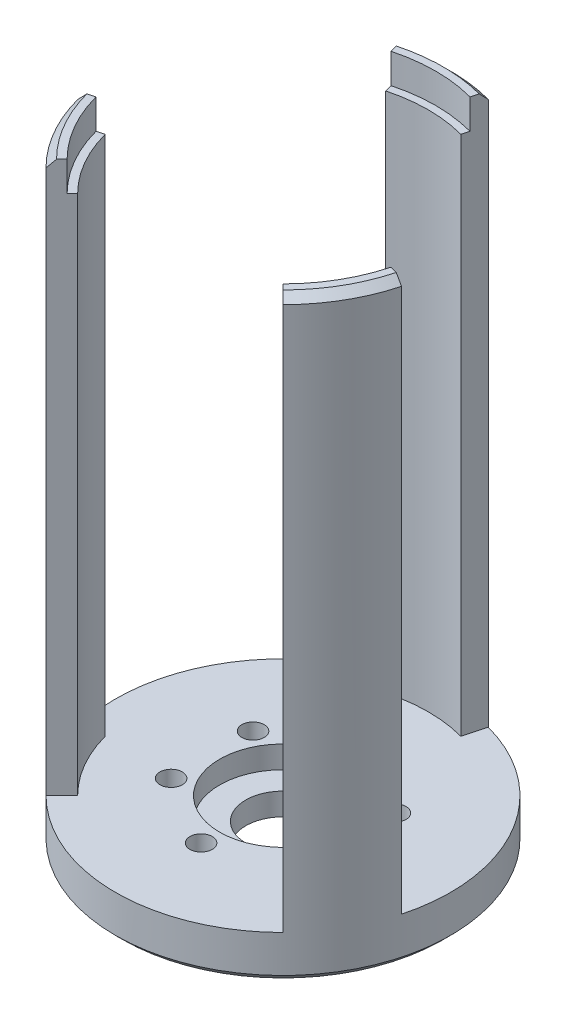
ISO-10303-21;
HEADER;
FILE_DESCRIPTION(('STEP AP214'),'2;1');
FILE_NAME('part.step','',(''),(''),'','','');
FILE_SCHEMA(('AUTOMOTIVE_DESIGN { 1 0 10303 214 1 1 1 1 }'));
ENDSEC;
DATA;
#1=APPLICATION_CONTEXT('core data for automotive mechanical design processes');
#2=APPLICATION_PROTOCOL_DEFINITION('international standard','automotive_design',2000,#1);
#3=PRODUCT_CONTEXT('',#1,'mechanical');
#4=PRODUCT('Part','Part','',(#3));
#5=PRODUCT_RELATED_PRODUCT_CATEGORY('part','',(#4));
#6=PRODUCT_DEFINITION_FORMATION('','',#4);
#7=PRODUCT_DEFINITION_CONTEXT('part definition',#1,'design');
#8=PRODUCT_DEFINITION('design','',#6,#7);
#9=PRODUCT_DEFINITION_SHAPE('','',#8);
#10=(LENGTH_UNIT() NAMED_UNIT(*) SI_UNIT(.MILLI.,.METRE.));
#11=(NAMED_UNIT(*) PLANE_ANGLE_UNIT() SI_UNIT($,.RADIAN.));
#12=(NAMED_UNIT(*) SI_UNIT($,.STERADIAN.) SOLID_ANGLE_UNIT());
#13=UNCERTAINTY_MEASURE_WITH_UNIT(LENGTH_MEASURE(1.E-05),#10,'distance_accuracy_value','');
#14=(GEOMETRIC_REPRESENTATION_CONTEXT(3) GLOBAL_UNCERTAINTY_ASSIGNED_CONTEXT((#13)) GLOBAL_UNIT_ASSIGNED_CONTEXT((#10,
#11,#12)) REPRESENTATION_CONTEXT('',''));
#15=CARTESIAN_POINT('',(0.,0.,0.));
#16=DIRECTION('',(0.,0.,1.));
#17=DIRECTION('',(1.,0.,0.));
#18=AXIS2_PLACEMENT_3D('',#15,#16,#17);
#19=CARTESIAN_POINT('',(0.,80.,0.));
#20=DIRECTION('',(0.,-1.,0.));
#21=DIRECTION('',(0.,0.,-1.));
#22=AXIS2_PLACEMENT_3D('',#19,#20,#21);
#23=CYLINDRICAL_SURFACE('',#22,19.5);
#24=CARTESIAN_POINT('',(0.,76.,0.));
#25=DIRECTION('',(0.,1.,0.));
#26=DIRECTION('',(0.,0.,1.));
#27=AXIS2_PLACEMENT_3D('',#24,#25,#26);
#28=CIRCLE('',#27,19.5);
#29=CARTESIAN_POINT('',(18.8355536126368,76.,5.04697137949923));
#30=VERTEX_POINT('',#29);
#31=CARTESIAN_POINT('',(13.7885822331376,76.,13.7885822331378));
#32=VERTEX_POINT('',#31);
#33=EDGE_CURVE('E196',#30,#32,#28,.F.);
#34=ORIENTED_EDGE('',*,*,#33,.F.);
#35=DIRECTION('',(0.,-1.,0.));
#36=VECTOR('',#35,1.);
#37=CARTESIAN_POINT('',(18.8355536126368,80.,5.04697137949923));
#38=LINE('',#37,#36);
#39=CARTESIAN_POINT('',(18.8355536126368,6.,5.04697137949923));
#40=VERTEX_POINT('',#39);
#41=EDGE_CURVE('E314',#30,#40,#38,.T.);
#42=ORIENTED_EDGE('',*,*,#41,.T.);
#43=CARTESIAN_POINT('',(0.,6.,0.));
#44=DIRECTION('',(0.,-1.,0.));
#45=DIRECTION('',(0.,0.,1.));
#46=AXIS2_PLACEMENT_3D('',#43,#44,#45);
#47=CIRCLE('',#46,19.5);
#48=CARTESIAN_POINT('',(13.7885822331376,6.,13.7885822331378));
#49=VERTEX_POINT('',#48);
#50=EDGE_CURVE('E307',#40,#49,#47,.T.);
#51=ORIENTED_EDGE('',*,*,#50,.T.);
#52=DIRECTION('',(0.,-1.,0.));
#53=VECTOR('',#52,1.);
#54=CARTESIAN_POINT('',(13.7885822331376,80.,13.7885822331378));
#55=LINE('',#54,#53);
#56=EDGE_CURVE('E333',#32,#49,#55,.T.);
#57=ORIENTED_EDGE('',*,*,#56,.F.);
#58=EDGE_LOOP('',(#34,#42,#51,#57));
#59=FACE_BOUND('',#58,.T.);
#60=ADVANCED_FACE('F43',(#59),#23,.F.);
#61=CARTESIAN_POINT('',(0.,80.,0.));
#62=DIRECTION('',(0.,-1.,0.));
#63=DIRECTION('',(0.,0.,-1.));
#64=AXIS2_PLACEMENT_3D('',#61,#62,#63);
#65=CYLINDRICAL_SURFACE('',#64,19.5);
#66=CARTESIAN_POINT('',(0.,76.,0.));
#67=DIRECTION('',(0.,1.,0.));
#68=DIRECTION('',(0.,0.,1.));
#69=AXIS2_PLACEMENT_3D('',#66,#67,#68);
#70=CIRCLE('',#69,19.5);
#71=CARTESIAN_POINT('',(-5.04697137949917,76.,-18.8355536126368));
#72=VERTEX_POINT('',#71);
#73=CARTESIAN_POINT('',(5.04697137949917,76.,-18.8355536126368));
#74=VERTEX_POINT('',#73);
#75=EDGE_CURVE('E236',#72,#74,#70,.F.);
#76=ORIENTED_EDGE('',*,*,#75,.F.);
#77=DIRECTION('',(0.,-1.,0.));
#78=VECTOR('',#77,1.);
#79=CARTESIAN_POINT('',(-5.04697137949917,80.,-18.8355536126368));
#80=LINE('',#79,#78);
#81=CARTESIAN_POINT('',(-5.04697137949918,6.,-18.8355536126368));
#82=VERTEX_POINT('',#81);
#83=EDGE_CURVE('E285',#72,#82,#80,.T.);
#84=ORIENTED_EDGE('',*,*,#83,.T.);
#85=CARTESIAN_POINT('',(0.,6.,0.));
#86=DIRECTION('',(0.,-1.,0.));
#87=DIRECTION('',(0.,0.,1.));
#88=AXIS2_PLACEMENT_3D('',#85,#86,#87);
#89=CIRCLE('',#88,19.5);
#90=CARTESIAN_POINT('',(5.04697137949917,6.00000000000001,-18.8355536126368));
#91=VERTEX_POINT('',#90);
#92=EDGE_CURVE('E276',#82,#91,#89,.T.);
#93=ORIENTED_EDGE('',*,*,#92,.T.);
#94=DIRECTION('',(0.,-1.,0.));
#95=VECTOR('',#94,1.);
#96=CARTESIAN_POINT('',(5.04697137949917,80.,-18.8355536126368));
#97=LINE('',#96,#95);
#98=EDGE_CURVE('E304',#74,#91,#97,.T.);
#99=ORIENTED_EDGE('',*,*,#98,.F.);
#100=EDGE_LOOP('',(#76,#84,#93,#99));
#101=FACE_BOUND('',#100,.T.);
#102=ADVANCED_FACE('F550',(#101),#65,.F.);
#103=CARTESIAN_POINT('',(0.,80.,0.));
#104=DIRECTION('',(0.,-1.,0.));
#105=DIRECTION('',(0.,0.,-1.));
#106=AXIS2_PLACEMENT_3D('',#103,#104,#105);
#107=CYLINDRICAL_SURFACE('',#106,19.5);
#108=CARTESIAN_POINT('',(0.,76.,0.));
#109=DIRECTION('',(0.,1.,0.));
#110=DIRECTION('',(0.,0.,1.));
#111=AXIS2_PLACEMENT_3D('',#108,#109,#110);
#112=CIRCLE('',#111,19.5);
#113=CARTESIAN_POINT('',(-13.7885822331378,76.,13.7885822331376));
#114=VERTEX_POINT('',#113);
#115=CARTESIAN_POINT('',(-18.8355536126369,76.,5.04697137949897));
#116=VERTEX_POINT('',#115);
#117=EDGE_CURVE('E221',#114,#116,#112,.F.);
#118=ORIENTED_EDGE('',*,*,#117,.F.);
#119=DIRECTION('',(0.,-1.,0.));
#120=VECTOR('',#119,1.);
#121=CARTESIAN_POINT('',(-13.7885822331378,80.,13.7885822331376));
#122=LINE('',#121,#120);
#123=CARTESIAN_POINT('',(-13.7885822331378,6.,13.7885822331396));
#124=VERTEX_POINT('',#123);
#125=EDGE_CURVE('E254',#114,#124,#122,.T.);
#126=ORIENTED_EDGE('',*,*,#125,.T.);
#127=CARTESIAN_POINT('',(0.,6.,0.));
#128=DIRECTION('',(0.,-1.,0.));
#129=DIRECTION('',(0.,0.,1.));
#130=AXIS2_PLACEMENT_3D('',#127,#128,#129);
#131=CIRCLE('',#130,19.5);
#132=CARTESIAN_POINT('',(-18.8355536126369,6.00000000000001,5.04697137949897));
#133=VERTEX_POINT('',#132);
#134=EDGE_CURVE('E201',#124,#133,#131,.T.);
#135=ORIENTED_EDGE('',*,*,#134,.T.);
#136=DIRECTION('',(0.,-1.,0.));
#137=VECTOR('',#136,1.);
#138=CARTESIAN_POINT('',(-18.8355536126369,80.,5.04697137949897));
#139=LINE('',#138,#137);
#140=EDGE_CURVE('E273',#116,#133,#139,.T.);
#141=ORIENTED_EDGE('',*,*,#140,.F.);
#142=EDGE_LOOP('',(#118,#126,#135,#141));
#143=FACE_BOUND('',#142,.T.);
#144=ADVANCED_FACE('F579',(#143),#107,.F.);
#145=CARTESIAN_POINT('',(0.,6.,0.));
#146=DIRECTION('',(0.,1.,0.));
#147=DIRECTION('',(0.,0.,1.));
#148=AXIS2_PLACEMENT_3D('',#145,#146,#147);
#149=PLANE('',#148);
#150=CARTESIAN_POINT('',(0.,6.,0.));
#151=DIRECTION('',(0.,1.,0.));
#152=DIRECTION('',(0.,0.,1.));
#153=AXIS2_PLACEMENT_3D('',#150,#151,#152);
#154=CIRCLE('',#153,8.5);
#155=CARTESIAN_POINT('',(0.,6.,8.5));
#156=VERTEX_POINT('',#155);
#157=EDGE_CURVE('E366',#156,#156,#154,.T.);
#158=ORIENTED_EDGE('',*,*,#157,.F.);
#159=EDGE_LOOP('',(#158));
#160=FACE_BOUND('',#159,.T.);
#161=CARTESIAN_POINT('',(-9.52627944162778,6.,-5.5000000000018));
#162=DIRECTION('',(0.,1.,0.));
#163=DIRECTION('',(0.,0.,1.));
#164=AXIS2_PLACEMENT_3D('',#161,#162,#163);
#165=CIRCLE('',#164,1.5);
#166=CARTESIAN_POINT('',(-9.52627944162778,6.,-4.0000000000018));
#167=VERTEX_POINT('',#166);
#168=EDGE_CURVE('E375',#167,#167,#165,.T.);
#169=ORIENTED_EDGE('',*,*,#168,.F.);
#170=EDGE_LOOP('',(#169));
#171=FACE_BOUND('',#170,.T.);
#172=CARTESIAN_POINT('',(-1.2490009027033E-12,6.,11.));
#173=DIRECTION('',(0.,1.,0.));
#174=DIRECTION('',(0.,0.,1.));
#175=AXIS2_PLACEMENT_3D('',#172,#173,#174);
#176=CIRCLE('',#175,1.5);
#177=CARTESIAN_POINT('',(-1.2490009027033E-12,6.,12.5));
#178=VERTEX_POINT('',#177);
#179=EDGE_CURVE('E384',#178,#178,#176,.T.);
#180=ORIENTED_EDGE('',*,*,#179,.F.);
#181=EDGE_LOOP('',(#180));
#182=FACE_BOUND('',#181,.T.);
#183=CARTESIAN_POINT('',(9.52627944162903,6.,-5.49999999999964));
#184=DIRECTION('',(0.,1.,0.));
#185=DIRECTION('',(0.,0.,1.));
#186=AXIS2_PLACEMENT_3D('',#183,#184,#185);
#187=CIRCLE('',#186,1.5);
#188=CARTESIAN_POINT('',(9.52627944162903,6.,-3.99999999999964));
#189=VERTEX_POINT('',#188);
#190=EDGE_CURVE('E396',#189,#189,#187,.T.);
#191=ORIENTED_EDGE('',*,*,#190,.F.);
#192=EDGE_LOOP('',(#191));
#193=FACE_BOUND('',#192,.T.);
#194=CARTESIAN_POINT('',(0.,6.,-11.));
#195=DIRECTION('',(0.,1.,0.));
#196=DIRECTION('',(0.,0.,1.));
#197=AXIS2_PLACEMENT_3D('',#194,#195,#196);
#198=CIRCLE('',#197,1.5);
#199=CARTESIAN_POINT('',(0.,6.,-9.5));
#200=VERTEX_POINT('',#199);
#201=EDGE_CURVE('E404',#200,#200,#198,.T.);
#202=ORIENTED_EDGE('',*,*,#201,.F.);
#203=EDGE_LOOP('',(#202));
#204=FACE_BOUND('',#203,.T.);
#205=CARTESIAN_POINT('',(9.52627944162841,6.,5.50000000000072));
#206=DIRECTION('',(0.,1.,0.));
#207=DIRECTION('',(0.,0.,1.));
#208=AXIS2_PLACEMENT_3D('',#205,#206,#207);
#209=CIRCLE('',#208,1.5);
#210=CARTESIAN_POINT('',(9.52627944162841,6.,7.00000000000072));
#211=VERTEX_POINT('',#210);
#212=EDGE_CURVE('E392',#211,#211,#209,.T.);
#213=ORIENTED_EDGE('',*,*,#212,.F.);
#214=EDGE_LOOP('',(#213));
#215=FACE_BOUND('',#214,.T.);
#216=CARTESIAN_POINT('',(-9.52627944162966,6.,5.49999999999856));
#217=DIRECTION('',(0.,1.,0.));
#218=DIRECTION('',(0.,0.,1.));
#219=AXIS2_PLACEMENT_3D('',#216,#217,#218);
#220=CIRCLE('',#219,1.5);
#221=CARTESIAN_POINT('',(-9.52627944162966,6.,6.99999999999856));
#222=VERTEX_POINT('',#221);
#223=EDGE_CURVE('E380',#222,#222,#220,.T.);
#224=ORIENTED_EDGE('',*,*,#223,.F.);
#225=EDGE_LOOP('',(#224));
#226=FACE_BOUND('',#225,.T.);
#227=CARTESIAN_POINT('',(0.,6.,0.));
#228=DIRECTION('',(0.,1.,0.));
#229=DIRECTION('',(0.,0.,1.));
#230=AXIS2_PLACEMENT_3D('',#227,#228,#229);
#231=CIRCLE('',#230,22.5);
#232=CARTESIAN_POINT('',(-5.82342851480673,6.,-21.733331091504));
#233=VERTEX_POINT('',#232);
#234=CARTESIAN_POINT('',(-21.733331091504,6.,5.82342851480671));
#235=VERTEX_POINT('',#234);
#236=EDGE_CURVE('E417',#233,#235,#231,.T.);
#237=ORIENTED_EDGE('',*,*,#236,.T.);
#238=DIRECTION('',(-0.965925826289052,0.,0.25881904510258));
#239=VECTOR('',#238,1.);
#240=CARTESIAN_POINT('',(-18.8355536126369,6.,5.04697137949897));
#241=LINE('',#240,#239);
#242=EDGE_CURVE('E258',#133,#235,#241,.T.);
#243=ORIENTED_EDGE('',*,*,#242,.F.);
#244=ORIENTED_EDGE('',*,*,#134,.F.);
#245=DIRECTION('',(0.707106781186501,0.,-0.707106781186594));
#246=VECTOR('',#245,1.);
#247=CARTESIAN_POINT('',(-13.7885822331378,6.,13.7885822331376));
#248=LINE('',#247,#246);
#249=CARTESIAN_POINT('',(-15.9099025766973,6.,15.9099025766973));
#250=VERTEX_POINT('',#249);
#251=EDGE_CURVE('E251',#250,#124,#248,.T.);
#252=ORIENTED_EDGE('',*,*,#251,.F.);
#253=CARTESIAN_POINT('',(15.9099025766973,6.,15.9099025766973));
#254=VERTEX_POINT('',#253);
#255=EDGE_CURVE('E408',#250,#254,#231,.T.);
#256=ORIENTED_EDGE('',*,*,#255,.T.);
#257=DIRECTION('',(0.707106781186569,0.,0.707106781186526));
#258=VECTOR('',#257,1.);
#259=CARTESIAN_POINT('',(13.7885822331376,6.,13.7885822331378));
#260=LINE('',#259,#258);
#261=EDGE_CURVE('E318',#49,#254,#260,.T.);
#262=ORIENTED_EDGE('',*,*,#261,.F.);
#263=ORIENTED_EDGE('',*,*,#50,.F.);
#264=DIRECTION('',(-0.965925826289077,0.,-0.258819045102488));
#265=VECTOR('',#264,1.);
#266=CARTESIAN_POINT('',(18.8355536126368,6.,5.04697137949923));
#267=LINE('',#266,#265);
#268=CARTESIAN_POINT('',(21.733331091504,6.,5.8234285148067));
#269=VERTEX_POINT('',#268);
#270=EDGE_CURVE('E311',#269,#40,#267,.T.);
#271=ORIENTED_EDGE('',*,*,#270,.F.);
#272=CARTESIAN_POINT('',(5.82342851480673,6.,-21.733331091504));
#273=VERTEX_POINT('',#272);
#274=EDGE_CURVE('E412',#269,#273,#231,.T.);
#275=ORIENTED_EDGE('',*,*,#274,.T.);
#276=DIRECTION('',(0.258819045102522,0.,-0.965925826289068));
#277=VECTOR('',#276,1.);
#278=CARTESIAN_POINT('',(5.04697137949917,6.,-18.8355536126368));
#279=LINE('',#278,#277);
#280=EDGE_CURVE('E289',#91,#273,#279,.T.);
#281=ORIENTED_EDGE('',*,*,#280,.F.);
#282=ORIENTED_EDGE('',*,*,#92,.F.);
#283=DIRECTION('',(0.258819045102522,0.,0.965925826289068));
#284=VECTOR('',#283,1.);
#285=CARTESIAN_POINT('',(-5.04697137949917,6.,-18.8355536126368));
#286=LINE('',#285,#284);
#287=EDGE_CURVE('E282',#233,#82,#286,.T.);
#288=ORIENTED_EDGE('',*,*,#287,.F.);
#289=EDGE_LOOP('',(#237,#243,#244,#252,#256,#262,#263,#271,#275,#281,#282,#288));
#290=FACE_BOUND('',#289,.T.);
#291=ADVANCED_FACE('F483',(#160,#171,#182,#193,#204,#215,#226,#290),#149,.T.);
#292=CARTESIAN_POINT('',(9.52627944162903,6.,-5.49999999999964));
#293=DIRECTION('',(0.,-1.,0.));
#294=DIRECTION('',(0.,0.,-1.));
#295=AXIS2_PLACEMENT_3D('',#292,#293,#294);
#296=CYLINDRICAL_SURFACE('',#295,1.5);
#297=ORIENTED_EDGE('',*,*,#190,.T.);
#298=EDGE_LOOP('',(#297));
#299=FACE_BOUND('',#298,.T.);
#300=CARTESIAN_POINT('',(9.52627944162903,2.5,-5.49999999999964));
#301=DIRECTION('',(0.,-1.,0.));
#302=DIRECTION('',(0.,0.,-1.));
#303=AXIS2_PLACEMENT_3D('',#300,#301,#302);
#304=CIRCLE('',#303,1.5);
#305=CARTESIAN_POINT('',(9.52627944162903,2.5,-6.99999999999964));
#306=VERTEX_POINT('',#305);
#307=EDGE_CURVE('E370',#306,#306,#304,.T.);
#308=ORIENTED_EDGE('',*,*,#307,.T.);
#309=EDGE_LOOP('',(#308));
#310=FACE_BOUND('',#309,.T.);
#311=ADVANCED_FACE('F586',(#299,#310),#296,.F.);
#312=CARTESIAN_POINT('',(-1.2490009027033E-12,6.,11.));
#313=DIRECTION('',(0.,-1.,0.));
#314=DIRECTION('',(0.,0.,-1.));
#315=AXIS2_PLACEMENT_3D('',#312,#313,#314);
#316=CYLINDRICAL_SURFACE('',#315,1.5);
#317=ORIENTED_EDGE('',*,*,#179,.T.);
#318=EDGE_LOOP('',(#317));
#319=FACE_BOUND('',#318,.T.);
#320=CARTESIAN_POINT('',(-1.2490009027033E-12,2.5,11.));
#321=DIRECTION('',(0.,-1.,0.));
#322=DIRECTION('',(0.,0.,-1.));
#323=AXIS2_PLACEMENT_3D('',#320,#321,#322);
#324=CIRCLE('',#323,1.5);
#325=CARTESIAN_POINT('',(-1.2490009027033E-12,2.5,9.5));
#326=VERTEX_POINT('',#325);
#327=EDGE_CURVE('E424',#326,#326,#324,.T.);
#328=ORIENTED_EDGE('',*,*,#327,.T.);
#329=EDGE_LOOP('',(#328));
#330=FACE_BOUND('',#329,.T.);
#331=ADVANCED_FACE('F640',(#319,#330),#316,.F.);
#332=CARTESIAN_POINT('',(-9.52627944162778,6.,-5.5000000000018));
#333=DIRECTION('',(0.,-1.,0.));
#334=DIRECTION('',(0.,0.,-1.));
#335=AXIS2_PLACEMENT_3D('',#332,#333,#334);
#336=CYLINDRICAL_SURFACE('',#335,1.5);
#337=ORIENTED_EDGE('',*,*,#168,.T.);
#338=EDGE_LOOP('',(#337));
#339=FACE_BOUND('',#338,.T.);
#340=CARTESIAN_POINT('',(-9.52627944162778,2.5,-5.5000000000018));
#341=DIRECTION('',(0.,-1.,0.));
#342=DIRECTION('',(0.,0.,-1.));
#343=AXIS2_PLACEMENT_3D('',#340,#341,#342);
#344=CIRCLE('',#343,1.5);
#345=CARTESIAN_POINT('',(-9.52627944162778,2.5,-7.0000000000018));
#346=VERTEX_POINT('',#345);
#347=EDGE_CURVE('E341',#346,#346,#344,.T.);
#348=ORIENTED_EDGE('',*,*,#347,.T.);
#349=EDGE_LOOP('',(#348));
#350=FACE_BOUND('',#349,.T.);
#351=ADVANCED_FACE('F636',(#339,#350),#336,.F.);
#352=CARTESIAN_POINT('',(0.,6.,0.));
#353=DIRECTION('',(0.,-1.,0.));
#354=DIRECTION('',(0.,0.,-1.));
#355=AXIS2_PLACEMENT_3D('',#352,#353,#354);
#356=CYLINDRICAL_SURFACE('',#355,5.);
#357=CARTESIAN_POINT('',(0.,0.,0.));
#358=DIRECTION('',(0.,1.,0.));
#359=DIRECTION('',(0.,0.,1.));
#360=AXIS2_PLACEMENT_3D('',#357,#358,#359);
#361=CIRCLE('',#360,5.);
#362=CARTESIAN_POINT('',(0.,0.,5.));
#363=VERTEX_POINT('',#362);
#364=EDGE_CURVE('E371',#363,#363,#361,.T.);
#365=ORIENTED_EDGE('',*,*,#364,.F.);
#366=EDGE_LOOP('',(#365));
#367=FACE_BOUND('',#366,.T.);
#368=CARTESIAN_POINT('',(0.,3.,0.));
#369=DIRECTION('',(0.,1.,0.));
#370=DIRECTION('',(0.,0.,1.));
#371=AXIS2_PLACEMENT_3D('',#368,#369,#370);
#372=CIRCLE('',#371,5.);
#373=CARTESIAN_POINT('',(0.,3.,5.));
#374=VERTEX_POINT('',#373);
#375=EDGE_CURVE('E365',#374,#374,#372,.T.);
#376=ORIENTED_EDGE('',*,*,#375,.T.);
#377=EDGE_LOOP('',(#376));
#378=FACE_BOUND('',#377,.T.);
#379=ADVANCED_FACE('F632',(#367,#378),#356,.F.);
#380=CARTESIAN_POINT('',(0.,0.,0.));
#381=DIRECTION('',(0.,1.,0.));
#382=DIRECTION('',(0.,0.,1.));
#383=AXIS2_PLACEMENT_3D('',#380,#381,#382);
#384=PLANE('',#383);
#385=CARTESIAN_POINT('',(0.,0.,0.));
#386=DIRECTION('',(0.,1.,0.));
#387=DIRECTION('',(0.,0.,1.));
#388=AXIS2_PLACEMENT_3D('',#385,#386,#387);
#389=CIRCLE('',#388,21.5);
#390=CARTESIAN_POINT('',(0.,0.,21.5));
#391=VERTEX_POINT('',#390);
#392=EDGE_CURVE('E11',#391,#391,#389,.F.);
#393=ORIENTED_EDGE('',*,*,#392,.T.);
#394=EDGE_LOOP('',(#393));
#395=FACE_BOUND('',#394,.T.);
#396=CARTESIAN_POINT('',(-1.2490009027033E-12,0.,11.));
#397=DIRECTION('',(0.,-1.,0.));
#398=DIRECTION('',(0.,0.,-1.));
#399=AXIS2_PLACEMENT_3D('',#396,#397,#398);
#400=CIRCLE('',#399,3.25);
#401=CARTESIAN_POINT('',(-1.2490009027033E-12,0.,7.75));
#402=VERTEX_POINT('',#401);
#403=EDGE_CURVE('E342',#402,#402,#400,.T.);
#404=ORIENTED_EDGE('',*,*,#403,.F.);
#405=EDGE_LOOP('',(#404));
#406=FACE_BOUND('',#405,.T.);
#407=CARTESIAN_POINT('',(9.52627944162945,0.,-5.49999999999892));
#408=DIRECTION('',(0.,-1.,0.));
#409=DIRECTION('',(0.,0.,-1.));
#410=AXIS2_PLACEMENT_3D('',#407,#408,#409);
#411=CIRCLE('',#410,3.25000000000105);
#412=CARTESIAN_POINT('',(9.52627944162945,0.,-8.74999999999997));
#413=VERTEX_POINT('',#412);
#414=EDGE_CURVE('E350',#413,#413,#411,.T.);
#415=ORIENTED_EDGE('',*,*,#414,.F.);
#416=EDGE_LOOP('',(#415));
#417=FACE_BOUND('',#416,.T.);
#418=CARTESIAN_POINT('',(-9.5262794416282,0.,-5.50000000000109));
#419=DIRECTION('',(0.,-1.,0.));
#420=DIRECTION('',(0.,0.,-1.));
#421=AXIS2_PLACEMENT_3D('',#418,#419,#420);
#422=CIRCLE('',#421,3.25000000000074);
#423=CARTESIAN_POINT('',(-9.5262794416282,0.,-8.75000000000182));
#424=VERTEX_POINT('',#423);
#425=EDGE_CURVE('E336',#424,#424,#422,.T.);
#426=ORIENTED_EDGE('',*,*,#425,.F.);
#427=EDGE_LOOP('',(#426));
#428=FACE_BOUND('',#427,.T.);
#429=CARTESIAN_POINT('',(0.,0.,-11.));
#430=DIRECTION('',(0.,1.,0.));
#431=DIRECTION('',(0.,0.,1.));
#432=AXIS2_PLACEMENT_3D('',#429,#430,#431);
#433=CIRCLE('',#432,1.5);
#434=CARTESIAN_POINT('',(0.,0.,-9.5));
#435=VERTEX_POINT('',#434);
#436=EDGE_CURVE('E403',#435,#435,#433,.T.);
#437=ORIENTED_EDGE('',*,*,#436,.T.);
#438=EDGE_LOOP('',(#437));
#439=FACE_BOUND('',#438,.T.);
#440=CARTESIAN_POINT('',(9.52627944162841,0.,5.50000000000072));
#441=DIRECTION('',(0.,1.,0.));
#442=DIRECTION('',(0.,0.,1.));
#443=AXIS2_PLACEMENT_3D('',#440,#441,#442);
#444=CIRCLE('',#443,1.5);
#445=CARTESIAN_POINT('',(9.52627944162841,0.,7.00000000000072));
#446=VERTEX_POINT('',#445);
#447=EDGE_CURVE('E391',#446,#446,#444,.T.);
#448=ORIENTED_EDGE('',*,*,#447,.T.);
#449=EDGE_LOOP('',(#448));
#450=FACE_BOUND('',#449,.T.);
#451=CARTESIAN_POINT('',(-9.52627944162966,0.,5.49999999999856));
#452=DIRECTION('',(0.,1.,0.));
#453=DIRECTION('',(0.,0.,1.));
#454=AXIS2_PLACEMENT_3D('',#451,#452,#453);
#455=CIRCLE('',#454,1.5);
#456=CARTESIAN_POINT('',(-9.52627944162966,0.,6.99999999999856));
#457=VERTEX_POINT('',#456);
#458=EDGE_CURVE('E379',#457,#457,#455,.T.);
#459=ORIENTED_EDGE('',*,*,#458,.T.);
#460=EDGE_LOOP('',(#459));
#461=FACE_BOUND('',#460,.T.);
#462=ORIENTED_EDGE('',*,*,#364,.T.);
#463=EDGE_LOOP('',(#462));
#464=FACE_BOUND('',#463,.T.);
#465=ADVANCED_FACE('F635',(#395,#406,#417,#428,#439,#450,#461,#464),#384,.F.);
#466=CARTESIAN_POINT('',(0.,6.,0.));
#467=DIRECTION('',(0.,-1.,0.));
#468=DIRECTION('',(0.,0.,-1.));
#469=AXIS2_PLACEMENT_3D('',#466,#467,#468);
#470=CYLINDRICAL_SURFACE('',#469,22.5);
#471=CARTESIAN_POINT('',(0.,1.,0.));
#472=DIRECTION('',(0.,1.,0.));
#473=DIRECTION('',(0.,0.,1.));
#474=AXIS2_PLACEMENT_3D('',#471,#472,#473);
#475=CIRCLE('',#474,22.5);
#476=CARTESIAN_POINT('',(0.,1.,22.5));
#477=VERTEX_POINT('',#476);
#478=EDGE_CURVE('E444',#477,#477,#475,.T.);
#479=ORIENTED_EDGE('',*,*,#478,.T.);
#480=EDGE_LOOP('',(#479));
#481=FACE_BOUND('',#480,.T.);
#482=DIRECTION('',(0.,-1.,0.));
#483=VECTOR('',#482,1.);
#484=CARTESIAN_POINT('',(-5.82342851480673,80.,-21.733331091504));
#485=LINE('',#484,#483);
#486=CARTESIAN_POINT('',(-5.82342851480673,79.,-21.733331091504));
#487=VERTEX_POINT('',#486);
#488=EDGE_CURVE('E298',#487,#233,#485,.T.);
#489=ORIENTED_EDGE('',*,*,#488,.F.);
#490=CARTESIAN_POINT('',(0.,79.,0.));
#491=DIRECTION('',(0.,1.,0.));
#492=DIRECTION('',(0.,0.,1.));
#493=AXIS2_PLACEMENT_3D('',#490,#491,#492);
#494=CIRCLE('',#493,22.5);
#495=CARTESIAN_POINT('',(5.82342851480673,79.,-21.733331091504));
#496=VERTEX_POINT('',#495);
#497=EDGE_CURVE('E454',#487,#496,#494,.F.);
#498=ORIENTED_EDGE('',*,*,#497,.T.);
#499=DIRECTION('',(0.,-1.,0.));
#500=VECTOR('',#499,1.);
#501=CARTESIAN_POINT('',(5.82342851480673,80.,-21.733331091504));
#502=LINE('',#501,#500);
#503=EDGE_CURVE('E301',#496,#273,#502,.T.);
#504=ORIENTED_EDGE('',*,*,#503,.T.);
#505=ORIENTED_EDGE('',*,*,#274,.F.);
#506=DIRECTION('',(0.,-1.,0.));
#507=VECTOR('',#506,1.);
#508=CARTESIAN_POINT('',(21.7333310915041,80.,5.8234285148067));
#509=LINE('',#508,#507);
#510=CARTESIAN_POINT('',(21.7333310915041,79.,5.8234285148067));
#511=VERTEX_POINT('',#510);
#512=EDGE_CURVE('E327',#511,#269,#509,.T.);
#513=ORIENTED_EDGE('',*,*,#512,.F.);
#514=CARTESIAN_POINT('',(0.,79.,0.));
#515=DIRECTION('',(0.,1.,0.));
#516=DIRECTION('',(0.,0.,1.));
#517=AXIS2_PLACEMENT_3D('',#514,#515,#516);
#518=CIRCLE('',#517,22.5);
#519=CARTESIAN_POINT('',(15.9099025766973,79.,15.9099025766973));
#520=VERTEX_POINT('',#519);
#521=EDGE_CURVE('E451',#511,#520,#518,.F.);
#522=ORIENTED_EDGE('',*,*,#521,.T.);
#523=DIRECTION('',(0.,-1.,0.));
#524=VECTOR('',#523,1.);
#525=CARTESIAN_POINT('',(15.9099025766973,80.,15.9099025766973));
#526=LINE('',#525,#524);
#527=EDGE_CURVE('E330',#520,#254,#526,.T.);
#528=ORIENTED_EDGE('',*,*,#527,.T.);
#529=ORIENTED_EDGE('',*,*,#255,.F.);
#530=DIRECTION('',(0.,-1.,0.));
#531=VECTOR('',#530,1.);
#532=CARTESIAN_POINT('',(-15.9099025766973,80.,15.9099025766973));
#533=LINE('',#532,#531);
#534=CARTESIAN_POINT('',(-15.9099025766973,79.,15.9099025766973));
#535=VERTEX_POINT('',#534);
#536=EDGE_CURVE('E267',#535,#250,#533,.T.);
#537=ORIENTED_EDGE('',*,*,#536,.F.);
#538=CARTESIAN_POINT('',(0.,79.,0.));
#539=DIRECTION('',(0.,1.,0.));
#540=DIRECTION('',(0.,0.,1.));
#541=AXIS2_PLACEMENT_3D('',#538,#539,#540);
#542=CIRCLE('',#541,22.5);
#543=CARTESIAN_POINT('',(-21.733331091504,79.,5.82342851480671));
#544=VERTEX_POINT('',#543);
#545=EDGE_CURVE('E448',#535,#544,#542,.F.);
#546=ORIENTED_EDGE('',*,*,#545,.T.);
#547=DIRECTION('',(0.,-1.,0.));
#548=VECTOR('',#547,1.);
#549=CARTESIAN_POINT('',(-21.733331091504,80.,5.82342851480671));
#550=LINE('',#549,#548);
#551=EDGE_CURVE('E270',#544,#235,#550,.T.);
#552=ORIENTED_EDGE('',*,*,#551,.T.);
#553=ORIENTED_EDGE('',*,*,#236,.F.);
#554=EDGE_LOOP('',(#489,#498,#504,#505,#513,#522,#528,#529,#537,#546,#552,#553));
#555=FACE_BOUND('',#554,.T.);
#556=ADVANCED_FACE('F499',(#481,#555),#470,.T.);
#557=CARTESIAN_POINT('',(0.,6.,-11.));
#558=DIRECTION('',(0.,-1.,0.));
#559=DIRECTION('',(0.,0.,-1.));
#560=AXIS2_PLACEMENT_3D('',#557,#558,#559);
#561=CYLINDRICAL_SURFACE('',#560,1.5);
#562=ORIENTED_EDGE('',*,*,#201,.T.);
#563=EDGE_LOOP('',(#562));
#564=FACE_BOUND('',#563,.T.);
#565=ORIENTED_EDGE('',*,*,#436,.F.);
#566=EDGE_LOOP('',(#565));
#567=FACE_BOUND('',#566,.T.);
#568=ADVANCED_FACE('F651',(#564,#567),#561,.F.);
#569=CARTESIAN_POINT('',(9.52627944162841,6.,5.50000000000072));
#570=DIRECTION('',(0.,-1.,0.));
#571=DIRECTION('',(0.,0.,-1.));
#572=AXIS2_PLACEMENT_3D('',#569,#570,#571);
#573=CYLINDRICAL_SURFACE('',#572,1.5);
#574=ORIENTED_EDGE('',*,*,#212,.T.);
#575=EDGE_LOOP('',(#574));
#576=FACE_BOUND('',#575,.T.);
#577=ORIENTED_EDGE('',*,*,#447,.F.);
#578=EDGE_LOOP('',(#577));
#579=FACE_BOUND('',#578,.T.);
#580=ADVANCED_FACE('F644',(#576,#579),#573,.F.);
#581=CARTESIAN_POINT('',(-9.52627944162966,6.,5.49999999999856));
#582=DIRECTION('',(0.,-1.,0.));
#583=DIRECTION('',(0.,0.,-1.));
#584=AXIS2_PLACEMENT_3D('',#581,#582,#583);
#585=CYLINDRICAL_SURFACE('',#584,1.5);
#586=ORIENTED_EDGE('',*,*,#223,.T.);
#587=EDGE_LOOP('',(#586));
#588=FACE_BOUND('',#587,.T.);
#589=ORIENTED_EDGE('',*,*,#458,.F.);
#590=EDGE_LOOP('',(#589));
#591=FACE_BOUND('',#590,.T.);
#592=ADVANCED_FACE('F630',(#588,#591),#585,.F.);
#593=CARTESIAN_POINT('',(0.,3.,0.));
#594=DIRECTION('',(0.,1.,0.));
#595=DIRECTION('',(0.,0.,1.));
#596=AXIS2_PLACEMENT_3D('',#593,#594,#595);
#597=CYLINDRICAL_SURFACE('',#596,8.5);
#598=CARTESIAN_POINT('',(0.,3.,0.));
#599=DIRECTION('',(0.,1.,0.));
#600=DIRECTION('',(0.,0.,1.));
#601=AXIS2_PLACEMENT_3D('',#598,#599,#600);
#602=CIRCLE('',#601,8.5);
#603=CARTESIAN_POINT('',(0.,3.,8.5));
#604=VERTEX_POINT('',#603);
#605=EDGE_CURVE('E361',#604,#604,#602,.T.);
#606=ORIENTED_EDGE('',*,*,#605,.F.);
#607=EDGE_LOOP('',(#606));
#608=FACE_BOUND('',#607,.T.);
#609=ORIENTED_EDGE('',*,*,#157,.T.);
#610=EDGE_LOOP('',(#609));
#611=FACE_BOUND('',#610,.T.);
#612=ADVANCED_FACE('F626',(#608,#611),#597,.F.);
#613=CARTESIAN_POINT('',(0.,3.,0.));
#614=DIRECTION('',(0.,1.,0.));
#615=DIRECTION('',(0.,0.,1.));
#616=AXIS2_PLACEMENT_3D('',#613,#614,#615);
#617=PLANE('',#616);
#618=ORIENTED_EDGE('',*,*,#375,.F.);
#619=EDGE_LOOP('',(#618));
#620=FACE_BOUND('',#619,.T.);
#621=ORIENTED_EDGE('',*,*,#605,.T.);
#622=EDGE_LOOP('',(#621));
#623=FACE_BOUND('',#622,.T.);
#624=ADVANCED_FACE('F622',(#620,#623),#617,.T.);
#625=CARTESIAN_POINT('',(-9.5262794416282,2.5,-5.50000000000109));
#626=DIRECTION('',(0.,-1.,0.));
#627=DIRECTION('',(0.,0.,-1.));
#628=AXIS2_PLACEMENT_3D('',#625,#626,#627);
#629=CYLINDRICAL_SURFACE('',#628,3.25000000000074);
#630=CARTESIAN_POINT('',(-9.5262794416282,2.5,-5.50000000000109));
#631=DIRECTION('',(0.,-1.,0.));
#632=DIRECTION('',(0.,0.,-1.));
#633=AXIS2_PLACEMENT_3D('',#630,#631,#632);
#634=CIRCLE('',#633,3.25000000000074);
#635=CARTESIAN_POINT('',(-9.5262794416282,2.5,-8.75000000000182));
#636=VERTEX_POINT('',#635);
#637=EDGE_CURVE('E354',#636,#636,#634,.T.);
#638=ORIENTED_EDGE('',*,*,#637,.F.);
#639=EDGE_LOOP('',(#638));
#640=FACE_BOUND('',#639,.T.);
#641=ORIENTED_EDGE('',*,*,#425,.T.);
#642=EDGE_LOOP('',(#641));
#643=FACE_BOUND('',#642,.T.);
#644=ADVANCED_FACE('F618',(#640,#643),#629,.F.);
#645=CARTESIAN_POINT('',(-9.5262794416282,2.5,-5.50000000000109));
#646=DIRECTION('',(0.,-1.,0.));
#647=DIRECTION('',(0.,0.,-1.));
#648=AXIS2_PLACEMENT_3D('',#645,#646,#647);
#649=PLANE('',#648);
#650=ORIENTED_EDGE('',*,*,#347,.F.);
#651=EDGE_LOOP('',(#650));
#652=FACE_BOUND('',#651,.T.);
#653=ORIENTED_EDGE('',*,*,#637,.T.);
#654=EDGE_LOOP('',(#653));
#655=FACE_BOUND('',#654,.T.);
#656=ADVANCED_FACE('F607',(#652,#655),#649,.T.);
#657=CARTESIAN_POINT('',(-1.2490009027033E-12,2.5,11.));
#658=DIRECTION('',(0.,-1.,0.));
#659=DIRECTION('',(0.,0.,-1.));
#660=AXIS2_PLACEMENT_3D('',#657,#658,#659);
#661=CYLINDRICAL_SURFACE('',#660,3.25);
#662=CARTESIAN_POINT('',(-1.2490009027033E-12,2.5,11.));
#663=DIRECTION('',(0.,-1.,0.));
#664=DIRECTION('',(0.,0.,-1.));
#665=AXIS2_PLACEMENT_3D('',#662,#663,#664);
#666=CIRCLE('',#665,3.25);
#667=CARTESIAN_POINT('',(-1.2490009027033E-12,2.5,7.75));
#668=VERTEX_POINT('',#667);
#669=EDGE_CURVE('E337',#668,#668,#666,.T.);
#670=ORIENTED_EDGE('',*,*,#669,.F.);
#671=EDGE_LOOP('',(#670));
#672=FACE_BOUND('',#671,.T.);
#673=ORIENTED_EDGE('',*,*,#403,.T.);
#674=EDGE_LOOP('',(#673));
#675=FACE_BOUND('',#674,.T.);
#676=ADVANCED_FACE('F603',(#672,#675),#661,.F.);
#677=CARTESIAN_POINT('',(-1.2490009027033E-12,2.5,11.));
#678=DIRECTION('',(0.,-1.,0.));
#679=DIRECTION('',(0.,0.,-1.));
#680=AXIS2_PLACEMENT_3D('',#677,#678,#679);
#681=PLANE('',#680);
#682=ORIENTED_EDGE('',*,*,#327,.F.);
#683=EDGE_LOOP('',(#682));
#684=FACE_BOUND('',#683,.T.);
#685=ORIENTED_EDGE('',*,*,#669,.T.);
#686=EDGE_LOOP('',(#685));
#687=FACE_BOUND('',#686,.T.);
#688=ADVANCED_FACE('F599',(#684,#687),#681,.T.);
#689=CARTESIAN_POINT('',(9.52627944162945,2.5,-5.49999999999892));
#690=DIRECTION('',(0.,-1.,0.));
#691=DIRECTION('',(0.,0.,-1.));
#692=AXIS2_PLACEMENT_3D('',#689,#690,#691);
#693=CYLINDRICAL_SURFACE('',#692,3.25000000000105);
#694=CARTESIAN_POINT('',(9.52627944162945,2.5,-5.49999999999892));
#695=DIRECTION('',(0.,-1.,0.));
#696=DIRECTION('',(0.,0.,-1.));
#697=AXIS2_PLACEMENT_3D('',#694,#695,#696);
#698=CIRCLE('',#697,3.25000000000105);
#699=CARTESIAN_POINT('',(9.52627944162945,2.5,-8.74999999999997));
#700=VERTEX_POINT('',#699);
#701=EDGE_CURVE('E346',#700,#700,#698,.T.);
#702=ORIENTED_EDGE('',*,*,#701,.F.);
#703=EDGE_LOOP('',(#702));
#704=FACE_BOUND('',#703,.T.);
#705=ORIENTED_EDGE('',*,*,#414,.T.);
#706=EDGE_LOOP('',(#705));
#707=FACE_BOUND('',#706,.T.);
#708=ADVANCED_FACE('F602',(#704,#707),#693,.F.);
#709=CARTESIAN_POINT('',(9.52627944162945,2.5,-5.49999999999892));
#710=DIRECTION('',(0.,-1.,0.));
#711=DIRECTION('',(0.,0.,-1.));
#712=AXIS2_PLACEMENT_3D('',#709,#710,#711);
#713=PLANE('',#712);
#714=ORIENTED_EDGE('',*,*,#307,.F.);
#715=EDGE_LOOP('',(#714));
#716=FACE_BOUND('',#715,.T.);
#717=ORIENTED_EDGE('',*,*,#701,.T.);
#718=EDGE_LOOP('',(#717));
#719=FACE_BOUND('',#718,.T.);
#720=ADVANCED_FACE('F609',(#716,#719),#713,.T.);
#721=CARTESIAN_POINT('',(13.7885822331376,80.,13.7885822331378));
#722=DIRECTION('',(0.707106781186526,0.,-0.707106781186569));
#723=DIRECTION('',(-0.707106781186569,0.,-0.707106781186526));
#724=AXIS2_PLACEMENT_3D('',#721,#722,#723);
#725=PLANE('',#724);
#726=ORIENTED_EDGE('',*,*,#527,.F.);
#727=DIRECTION('',(0.500000000000013,-0.707106781186551,0.499999999999982));
#728=VECTOR('',#727,1.);
#729=CARTESIAN_POINT('',(-4.88200623871972E-13,101.5,4.88200623872001E-13));
#730=LINE('',#729,#728);
#731=CARTESIAN_POINT('',(15.2027957955108,80.,15.2027957955108));
#732=VERTEX_POINT('',#731);
#733=EDGE_CURVE('E467',#520,#732,#730,.F.);
#734=ORIENTED_EDGE('',*,*,#733,.T.);
#735=DIRECTION('',(0.707106781186569,0.,0.707106781186526));
#736=VECTOR('',#735,1.);
#737=CARTESIAN_POINT('',(13.7885822331376,80.,13.7885822331378));
#738=LINE('',#737,#736);
#739=CARTESIAN_POINT('',(14.4956890143242,80.,14.4956890143243));
#740=VERTEX_POINT('',#739);
#741=EDGE_CURVE('E219',#740,#732,#738,.T.);
#742=ORIENTED_EDGE('',*,*,#741,.F.);
#743=DIRECTION('',(0.,1.,0.));
#744=VECTOR('',#743,1.);
#745=CARTESIAN_POINT('',(14.4956890143242,76.,14.4956890143243));
#746=LINE('',#745,#744);
#747=CARTESIAN_POINT('',(14.4956890143242,76.,14.4956890143243));
#748=VERTEX_POINT('',#747);
#749=EDGE_CURVE('E206',#740,#748,#746,.F.);
#750=ORIENTED_EDGE('',*,*,#749,.T.);
#751=DIRECTION('',(0.707106781186569,0.,0.707106781186526));
#752=VECTOR('',#751,1.);
#753=CARTESIAN_POINT('',(13.7885822331376,76.,13.7885822331378));
#754=LINE('',#753,#752);
#755=EDGE_CURVE('E190',#32,#748,#754,.T.);
#756=ORIENTED_EDGE('',*,*,#755,.F.);
#757=ORIENTED_EDGE('',*,*,#56,.T.);
#758=ORIENTED_EDGE('',*,*,#261,.T.);
#759=EDGE_LOOP('',(#726,#734,#742,#750,#756,#757,#758));
#760=FACE_BOUND('',#759,.T.);
#761=ADVANCED_FACE('F217',(#760),#725,.F.);
#762=CARTESIAN_POINT('',(18.8355536126368,80.,5.04697137949923));
#763=DIRECTION('',(-0.258819045102488,0.,0.965925826289077));
#764=DIRECTION('',(0.965925826289077,0.,0.258819045102488));
#765=AXIS2_PLACEMENT_3D('',#762,#763,#764);
#766=PLANE('',#765);
#767=DIRECTION('',(-0.965925826289077,0.,-0.258819045102488));
#768=VECTOR('',#767,1.);
#769=CARTESIAN_POINT('',(18.8355536126368,80.,5.04697137949923));
#770=LINE('',#769,#768);
#771=CARTESIAN_POINT('',(20.767405265215,80.,5.56460946970422));
#772=VERTEX_POINT('',#771);
#773=CARTESIAN_POINT('',(19.8014794389259,80.,5.30579042460172));
#774=VERTEX_POINT('',#773);
#775=EDGE_CURVE('E310',#772,#774,#770,.T.);
#776=ORIENTED_EDGE('',*,*,#775,.F.);
#777=DIRECTION('',(-0.683012701892222,0.707106781186551,-0.183012701892195));
#778=VECTOR('',#777,1.);
#779=CARTESIAN_POINT('',(-1.9059178653012E-13,101.5,7.11298230835824E-13));
#780=LINE('',#779,#778);
#781=EDGE_CURVE('E464',#772,#511,#780,.F.);
#782=ORIENTED_EDGE('',*,*,#781,.T.);
#783=ORIENTED_EDGE('',*,*,#512,.T.);
#784=ORIENTED_EDGE('',*,*,#270,.T.);
#785=ORIENTED_EDGE('',*,*,#41,.F.);
#786=DIRECTION('',(-0.965925826289077,0.,-0.258819045102488));
#787=VECTOR('',#786,1.);
#788=CARTESIAN_POINT('',(18.8355536126368,76.,5.04697137949923));
#789=LINE('',#788,#787);
#790=CARTESIAN_POINT('',(19.8014794389259,76.,5.30579042460172));
#791=VERTEX_POINT('',#790);
#792=EDGE_CURVE('E242',#791,#30,#789,.T.);
#793=ORIENTED_EDGE('',*,*,#792,.F.);
#794=DIRECTION('',(0.,1.,0.));
#795=VECTOR('',#794,1.);
#796=CARTESIAN_POINT('',(19.8014794389259,76.,5.30579042460172));
#797=LINE('',#796,#795);
#798=EDGE_CURVE('E209',#791,#774,#797,.T.);
#799=ORIENTED_EDGE('',*,*,#798,.T.);
#800=EDGE_LOOP('',(#776,#782,#783,#784,#785,#793,#799));
#801=FACE_BOUND('',#800,.T.);
#802=ADVANCED_FACE('F495',(#801),#766,.F.);
#803=CARTESIAN_POINT('',(0.,80.,0.));
#804=DIRECTION('',(0.,1.,0.));
#805=DIRECTION('',(0.,0.,1.));
#806=AXIS2_PLACEMENT_3D('',#803,#804,#805);
#807=PLANE('',#806);
#808=ORIENTED_EDGE('',*,*,#741,.T.);
#809=CARTESIAN_POINT('',(0.,80.,0.));
#810=DIRECTION('',(0.,1.,0.));
#811=DIRECTION('',(0.,0.,1.));
#812=AXIS2_PLACEMENT_3D('',#809,#810,#811);
#813=CIRCLE('',#812,21.5);
#814=EDGE_CURVE('E460',#732,#772,#813,.T.);
#815=ORIENTED_EDGE('',*,*,#814,.T.);
#816=ORIENTED_EDGE('',*,*,#775,.T.);
#817=CARTESIAN_POINT('',(0.,80.,0.));
#818=DIRECTION('',(0.,1.,0.));
#819=DIRECTION('',(0.,0.,1.));
#820=AXIS2_PLACEMENT_3D('',#817,#818,#819);
#821=CIRCLE('',#820,20.5);
#822=EDGE_CURVE('E505',#740,#774,#821,.T.);
#823=ORIENTED_EDGE('',*,*,#822,.F.);
#824=EDGE_LOOP('',(#808,#815,#816,#823));
#825=FACE_BOUND('',#824,.T.);
#826=ADVANCED_FACE('F504',(#825),#807,.T.);
#827=CARTESIAN_POINT('',(5.04697137949917,80.,-18.8355536126368));
#828=DIRECTION('',(-0.965925826289068,0.,-0.258819045102522));
#829=DIRECTION('',(-0.258819045102522,0.,0.965925826289068));
#830=AXIS2_PLACEMENT_3D('',#827,#828,#829);
#831=PLANE('',#830);
#832=ORIENTED_EDGE('',*,*,#503,.F.);
#833=DIRECTION('',(0.183012701892221,-0.707106781186545,-0.683012701892222));
#834=VECTOR('',#833,1.);
#835=CARTESIAN_POINT('',(0.,101.5,0.));
#836=LINE('',#835,#834);
#837=CARTESIAN_POINT('',(5.56460946970421,80.,-20.767405265215));
#838=VERTEX_POINT('',#837);
#839=EDGE_CURVE('E457',#496,#838,#836,.F.);
#840=ORIENTED_EDGE('',*,*,#839,.T.);
#841=DIRECTION('',(0.258819045102522,0.,-0.965925826289068));
#842=VECTOR('',#841,1.);
#843=CARTESIAN_POINT('',(5.04697137949917,80.,-18.8355536126368));
#844=LINE('',#843,#842);
#845=CARTESIAN_POINT('',(5.30579042460169,80.,-19.8014794389259));
#846=VERTEX_POINT('',#845);
#847=EDGE_CURVE('E277',#846,#838,#844,.T.);
#848=ORIENTED_EDGE('',*,*,#847,.F.);
#849=DIRECTION('',(0.,1.,0.));
#850=VECTOR('',#849,1.);
#851=CARTESIAN_POINT('',(5.30579042460169,76.,-19.8014794389259));
#852=LINE('',#851,#850);
#853=CARTESIAN_POINT('',(5.30579042460169,76.,-19.8014794389259));
#854=VERTEX_POINT('',#853);
#855=EDGE_CURVE('E227',#846,#854,#852,.F.);
#856=ORIENTED_EDGE('',*,*,#855,.T.);
#857=DIRECTION('',(0.258819045102522,0.,-0.965925826289068));
#858=VECTOR('',#857,1.);
#859=CARTESIAN_POINT('',(5.04697137949917,76.,-18.8355536126368));
#860=LINE('',#859,#858);
#861=EDGE_CURVE('E239',#74,#854,#860,.T.);
#862=ORIENTED_EDGE('',*,*,#861,.F.);
#863=ORIENTED_EDGE('',*,*,#98,.T.);
#864=ORIENTED_EDGE('',*,*,#280,.T.);
#865=EDGE_LOOP('',(#832,#840,#848,#856,#862,#863,#864));
#866=FACE_BOUND('',#865,.T.);
#867=ADVANCED_FACE('F530',(#866),#831,.F.);
#868=CARTESIAN_POINT('',(-5.04697137949917,80.,-18.8355536126368));
#869=DIRECTION('',(0.965925826289068,0.,-0.258819045102522));
#870=DIRECTION('',(-0.258819045102522,0.,-0.965925826289068));
#871=AXIS2_PLACEMENT_3D('',#868,#869,#870);
#872=PLANE('',#871);
#873=DIRECTION('',(0.258819045102522,0.,0.965925826289068));
#874=VECTOR('',#873,1.);
#875=CARTESIAN_POINT('',(-5.04697137949917,80.,-18.8355536126368));
#876=LINE('',#875,#874);
#877=CARTESIAN_POINT('',(-5.56460946970421,80.,-20.767405265215));
#878=VERTEX_POINT('',#877);
#879=CARTESIAN_POINT('',(-5.30579042460169,80.,-19.8014794389259));
#880=VERTEX_POINT('',#879);
#881=EDGE_CURVE('E281',#878,#880,#876,.T.);
#882=ORIENTED_EDGE('',*,*,#881,.F.);
#883=DIRECTION('',(0.183012701892221,0.707106781186545,0.683012701892222));
#884=VECTOR('',#883,1.);
#885=CARTESIAN_POINT('',(0.,101.5,0.));
#886=LINE('',#885,#884);
#887=EDGE_CURVE('E441',#878,#487,#886,.F.);
#888=ORIENTED_EDGE('',*,*,#887,.T.);
#889=ORIENTED_EDGE('',*,*,#488,.T.);
#890=ORIENTED_EDGE('',*,*,#287,.T.);
#891=ORIENTED_EDGE('',*,*,#83,.F.);
#892=DIRECTION('',(0.258819045102522,0.,0.965925826289068));
#893=VECTOR('',#892,1.);
#894=CARTESIAN_POINT('',(-5.04697137949917,76.,-18.8355536126368));
#895=LINE('',#894,#893);
#896=CARTESIAN_POINT('',(-5.30579042460169,76.,-19.8014794389259));
#897=VERTEX_POINT('',#896);
#898=EDGE_CURVE('E233',#897,#72,#895,.T.);
#899=ORIENTED_EDGE('',*,*,#898,.F.);
#900=DIRECTION('',(0.,1.,0.));
#901=VECTOR('',#900,1.);
#902=CARTESIAN_POINT('',(-5.30579042460169,76.,-19.8014794389259));
#903=LINE('',#902,#901);
#904=EDGE_CURVE('E521',#897,#880,#903,.T.);
#905=ORIENTED_EDGE('',*,*,#904,.T.);
#906=EDGE_LOOP('',(#882,#888,#889,#890,#891,#899,#905));
#907=FACE_BOUND('',#906,.T.);
#908=ADVANCED_FACE('F542',(#907),#872,.F.);
#909=CARTESIAN_POINT('',(0.,80.,0.));
#910=DIRECTION('',(0.,1.,0.));
#911=DIRECTION('',(0.,0.,1.));
#912=AXIS2_PLACEMENT_3D('',#909,#910,#911);
#913=PLANE('',#912);
#914=ORIENTED_EDGE('',*,*,#847,.T.);
#915=CARTESIAN_POINT('',(0.,80.,0.));
#916=DIRECTION('',(0.,1.,0.));
#917=DIRECTION('',(0.,0.,1.));
#918=AXIS2_PLACEMENT_3D('',#915,#916,#917);
#919=CIRCLE('',#918,21.5);
#920=EDGE_CURVE('E437',#838,#878,#919,.T.);
#921=ORIENTED_EDGE('',*,*,#920,.T.);
#922=ORIENTED_EDGE('',*,*,#881,.T.);
#923=EDGE_CURVE('E507',#846,#880,#821,.T.);
#924=ORIENTED_EDGE('',*,*,#923,.F.);
#925=EDGE_LOOP('',(#914,#921,#922,#924));
#926=FACE_BOUND('',#925,.T.);
#927=ADVANCED_FACE('F538',(#926),#913,.T.);
#928=CARTESIAN_POINT('',(-18.8355536126369,80.,5.04697137949897));
#929=DIRECTION('',(0.258819045102581,0.,0.965925826289052));
#930=DIRECTION('',(0.965925826289052,0.,-0.258819045102581));
#931=AXIS2_PLACEMENT_3D('',#928,#929,#930);
#932=PLANE('',#931);
#933=ORIENTED_EDGE('',*,*,#551,.F.);
#934=DIRECTION('',(-0.683012701892206,-0.70710678118655,0.183012701892261));
#935=VECTOR('',#934,1.);
#936=CARTESIAN_POINT('',(-3.61428476223324E-13,101.5,-1.34886943656731E-12));
#937=LINE('',#936,#935);
#938=CARTESIAN_POINT('',(-20.767405265215,80.,5.56460946970413));
#939=VERTEX_POINT('',#938);
#940=EDGE_CURVE('E53',#544,#939,#937,.F.);
#941=ORIENTED_EDGE('',*,*,#940,.T.);
#942=DIRECTION('',(-0.965925826289052,0.,0.25881904510258));
#943=VECTOR('',#942,1.);
#944=CARTESIAN_POINT('',(-18.8355536126369,80.,5.04697137949897));
#945=LINE('',#944,#943);
#946=CARTESIAN_POINT('',(-19.8014794389259,80.,5.30579042460155));
#947=VERTEX_POINT('',#946);
#948=EDGE_CURVE('E247',#947,#939,#945,.T.);
#949=ORIENTED_EDGE('',*,*,#948,.F.);
#950=DIRECTION('',(0.,1.,0.));
#951=VECTOR('',#950,1.);
#952=CARTESIAN_POINT('',(-19.8014794389259,76.,5.30579042460155));
#953=LINE('',#952,#951);
#954=CARTESIAN_POINT('',(-19.8014794389259,76.,5.30579042460155));
#955=VERTEX_POINT('',#954);
#956=EDGE_CURVE('E517',#947,#955,#953,.F.);
#957=ORIENTED_EDGE('',*,*,#956,.T.);
#958=DIRECTION('',(-0.965925826289052,0.,0.258819045102581));
#959=VECTOR('',#958,1.);
#960=CARTESIAN_POINT('',(-18.8355536126369,76.,5.04697137949897));
#961=LINE('',#960,#959);
#962=EDGE_CURVE('E225',#116,#955,#961,.T.);
#963=ORIENTED_EDGE('',*,*,#962,.F.);
#964=ORIENTED_EDGE('',*,*,#140,.T.);
#965=ORIENTED_EDGE('',*,*,#242,.T.);
#966=EDGE_LOOP('',(#933,#941,#949,#957,#963,#964,#965));
#967=FACE_BOUND('',#966,.T.);
#968=ADVANCED_FACE('F560',(#967),#932,.F.);
#969=CARTESIAN_POINT('',(-13.7885822331378,80.,13.7885822331376));
#970=DIRECTION('',(-0.707106781186594,0.,-0.707106781186501));
#971=DIRECTION('',(-0.707106781186501,0.,0.707106781186594));
#972=AXIS2_PLACEMENT_3D('',#969,#970,#971);
#973=PLANE('',#972);
#974=DIRECTION('',(0.707106781186501,0.,-0.707106781186594));
#975=VECTOR('',#974,1.);
#976=CARTESIAN_POINT('',(-13.7885822331378,80.,13.7885822331376));
#977=LINE('',#976,#975);
#978=CARTESIAN_POINT('',(-15.2027957955108,80.,15.2027957955107));
#979=VERTEX_POINT('',#978);
#980=CARTESIAN_POINT('',(-14.4956890143243,80.,14.4956890143242));
#981=VERTEX_POINT('',#980);
#982=EDGE_CURVE('E250',#979,#981,#977,.T.);
#983=ORIENTED_EDGE('',*,*,#982,.F.);
#984=DIRECTION('',(0.499999999999965,0.70710678118655,-0.500000000000031));
#985=VECTOR('',#984,1.);
#986=CARTESIAN_POINT('',(-1.03527971494468E-12,101.5,-1.03527971494455E-12));
#987=LINE('',#986,#985);
#988=EDGE_CURVE('E60',#979,#535,#987,.F.);
#989=ORIENTED_EDGE('',*,*,#988,.T.);
#990=ORIENTED_EDGE('',*,*,#536,.T.);
#991=ORIENTED_EDGE('',*,*,#251,.T.);
#992=ORIENTED_EDGE('',*,*,#125,.F.);
#993=DIRECTION('',(0.707106781186501,0.,-0.707106781186594));
#994=VECTOR('',#993,1.);
#995=CARTESIAN_POINT('',(-13.7885822331378,76.,13.7885822331376));
#996=LINE('',#995,#994);
#997=CARTESIAN_POINT('',(-14.4956890143243,76.,14.4956890143241));
#998=VERTEX_POINT('',#997);
#999=EDGE_CURVE('E434',#998,#114,#996,.T.);
#1000=ORIENTED_EDGE('',*,*,#999,.F.);
#1001=DIRECTION('',(0.,1.,0.));
#1002=VECTOR('',#1001,1.);
#1003=CARTESIAN_POINT('',(-14.4956890143243,76.,14.4956890143241));
#1004=LINE('',#1003,#1002);
#1005=EDGE_CURVE('E211',#998,#981,#1004,.T.);
#1006=ORIENTED_EDGE('',*,*,#1005,.T.);
#1007=EDGE_LOOP('',(#983,#989,#990,#991,#992,#1000,#1006));
#1008=FACE_BOUND('',#1007,.T.);
#1009=ADVANCED_FACE('F567',(#1008),#973,.F.);
#1010=CARTESIAN_POINT('',(0.,80.,0.));
#1011=DIRECTION('',(0.,1.,0.));
#1012=DIRECTION('',(0.,0.,1.));
#1013=AXIS2_PLACEMENT_3D('',#1010,#1011,#1012);
#1014=PLANE('',#1013);
#1015=ORIENTED_EDGE('',*,*,#948,.T.);
#1016=CARTESIAN_POINT('',(0.,80.,0.));
#1017=DIRECTION('',(0.,1.,0.));
#1018=DIRECTION('',(0.,0.,1.));
#1019=AXIS2_PLACEMENT_3D('',#1016,#1017,#1018);
#1020=CIRCLE('',#1019,21.5);
#1021=EDGE_CURVE('E470',#939,#979,#1020,.T.);
#1022=ORIENTED_EDGE('',*,*,#1021,.T.);
#1023=ORIENTED_EDGE('',*,*,#982,.T.);
#1024=CARTESIAN_POINT('',(0.,80.,0.));
#1025=DIRECTION('',(0.,1.,0.));
#1026=DIRECTION('',(0.,0.,1.));
#1027=AXIS2_PLACEMENT_3D('',#1024,#1025,#1026);
#1028=CIRCLE('',#1027,20.5);
#1029=EDGE_CURVE('E416',#947,#981,#1028,.T.);
#1030=ORIENTED_EDGE('',*,*,#1029,.F.);
#1031=EDGE_LOOP('',(#1015,#1022,#1023,#1030));
#1032=FACE_BOUND('',#1031,.T.);
#1033=ADVANCED_FACE('F564',(#1032),#1014,.T.);
#1034=CARTESIAN_POINT('',(0.,76.,0.));
#1035=DIRECTION('',(0.,1.,0.));
#1036=DIRECTION('',(0.,0.,1.));
#1037=AXIS2_PLACEMENT_3D('',#1034,#1035,#1036);
#1038=CYLINDRICAL_SURFACE('',#1037,20.5);
#1039=ORIENTED_EDGE('',*,*,#1029,.T.);
#1040=ORIENTED_EDGE('',*,*,#1005,.F.);
#1041=CARTESIAN_POINT('',(0.,76.,0.));
#1042=DIRECTION('',(0.,1.,0.));
#1043=DIRECTION('',(0.,0.,1.));
#1044=AXIS2_PLACEMENT_3D('',#1041,#1042,#1043);
#1045=CIRCLE('',#1044,20.5);
#1046=EDGE_CURVE('E214',#955,#998,#1045,.T.);
#1047=ORIENTED_EDGE('',*,*,#1046,.F.);
#1048=ORIENTED_EDGE('',*,*,#956,.F.);
#1049=EDGE_LOOP('',(#1039,#1040,#1047,#1048));
#1050=FACE_BOUND('',#1049,.T.);
#1051=ADVANCED_FACE('F572',(#1050),#1038,.F.);
#1052=CARTESIAN_POINT('',(0.,76.,0.));
#1053=DIRECTION('',(0.,1.,0.));
#1054=DIRECTION('',(0.,0.,1.));
#1055=AXIS2_PLACEMENT_3D('',#1052,#1053,#1054);
#1056=PLANE('',#1055);
#1057=ORIENTED_EDGE('',*,*,#962,.T.);
#1058=ORIENTED_EDGE('',*,*,#1046,.T.);
#1059=ORIENTED_EDGE('',*,*,#999,.T.);
#1060=ORIENTED_EDGE('',*,*,#117,.T.);
#1061=EDGE_LOOP('',(#1057,#1058,#1059,#1060));
#1062=FACE_BOUND('',#1061,.T.);
#1063=ADVANCED_FACE('F574',(#1062),#1056,.T.);
#1064=ORIENTED_EDGE('',*,*,#923,.T.);
#1065=ORIENTED_EDGE('',*,*,#904,.F.);
#1066=EDGE_CURVE('E212',#854,#897,#1045,.T.);
#1067=ORIENTED_EDGE('',*,*,#1066,.F.);
#1068=ORIENTED_EDGE('',*,*,#855,.F.);
#1069=EDGE_LOOP('',(#1064,#1065,#1067,#1068));
#1070=FACE_BOUND('',#1069,.T.);
#1071=ADVANCED_FACE('F535',(#1070),#1038,.F.);
#1072=ORIENTED_EDGE('',*,*,#861,.T.);
#1073=ORIENTED_EDGE('',*,*,#1066,.T.);
#1074=ORIENTED_EDGE('',*,*,#898,.T.);
#1075=ORIENTED_EDGE('',*,*,#75,.T.);
#1076=EDGE_LOOP('',(#1072,#1073,#1074,#1075));
#1077=FACE_BOUND('',#1076,.T.);
#1078=ADVANCED_FACE('F546',(#1077),#1056,.T.);
#1079=ORIENTED_EDGE('',*,*,#755,.T.);
#1080=EDGE_CURVE('E193',#748,#791,#1045,.T.);
#1081=ORIENTED_EDGE('',*,*,#1080,.T.);
#1082=ORIENTED_EDGE('',*,*,#792,.T.);
#1083=ORIENTED_EDGE('',*,*,#33,.T.);
#1084=EDGE_LOOP('',(#1079,#1081,#1082,#1083));
#1085=FACE_BOUND('',#1084,.T.);
#1086=ADVANCED_FACE('F192',(#1085),#1056,.T.);
#1087=ORIENTED_EDGE('',*,*,#822,.T.);
#1088=ORIENTED_EDGE('',*,*,#798,.F.);
#1089=ORIENTED_EDGE('',*,*,#1080,.F.);
#1090=ORIENTED_EDGE('',*,*,#749,.F.);
#1091=EDGE_LOOP('',(#1087,#1088,#1089,#1090));
#1092=FACE_BOUND('',#1091,.T.);
#1093=ADVANCED_FACE('F205',(#1092),#1038,.F.);
#1094=CARTESIAN_POINT('',(0.,80.,0.));
#1095=DIRECTION('',(0.,-1.,0.));
#1096=DIRECTION('',(0.,0.,-1.));
#1097=AXIS2_PLACEMENT_3D('',#1094,#1095,#1096);
#1098=CONICAL_SURFACE('',#1097,21.5,0.785398163397452);
#1099=ORIENTED_EDGE('',*,*,#839,.F.);
#1100=ORIENTED_EDGE('',*,*,#497,.F.);
#1101=ORIENTED_EDGE('',*,*,#887,.F.);
#1102=ORIENTED_EDGE('',*,*,#920,.F.);
#1103=EDGE_LOOP('',(#1099,#1100,#1101,#1102));
#1104=FACE_BOUND('',#1103,.T.);
#1105=ADVANCED_FACE('F559',(#1104),#1098,.T.);
#1106=CARTESIAN_POINT('',(0.,80.,0.));
#1107=DIRECTION('',(0.,-1.,0.));
#1108=DIRECTION('',(0.,0.,-1.));
#1109=AXIS2_PLACEMENT_3D('',#1106,#1107,#1108);
#1110=CONICAL_SURFACE('',#1109,21.5,0.785398163397443);
#1111=ORIENTED_EDGE('',*,*,#733,.F.);
#1112=ORIENTED_EDGE('',*,*,#521,.F.);
#1113=ORIENTED_EDGE('',*,*,#781,.F.);
#1114=ORIENTED_EDGE('',*,*,#814,.F.);
#1115=EDGE_LOOP('',(#1111,#1112,#1113,#1114));
#1116=FACE_BOUND('',#1115,.T.);
#1117=ADVANCED_FACE('F501',(#1116),#1110,.T.);
#1118=CARTESIAN_POINT('',(0.,80.,0.));
#1119=DIRECTION('',(0.,-1.,0.));
#1120=DIRECTION('',(0.,0.,-1.));
#1121=AXIS2_PLACEMENT_3D('',#1118,#1119,#1120);
#1122=CONICAL_SURFACE('',#1121,21.5,0.785398163397445);
#1123=ORIENTED_EDGE('',*,*,#940,.F.);
#1124=ORIENTED_EDGE('',*,*,#545,.F.);
#1125=ORIENTED_EDGE('',*,*,#988,.F.);
#1126=ORIENTED_EDGE('',*,*,#1021,.F.);
#1127=EDGE_LOOP('',(#1123,#1124,#1125,#1126));
#1128=FACE_BOUND('',#1127,.T.);
#1129=ADVANCED_FACE('F561',(#1128),#1122,.T.);
#1130=CARTESIAN_POINT('',(0.,1.,0.));
#1131=DIRECTION('',(0.,1.,0.));
#1132=DIRECTION('',(0.,0.,1.));
#1133=AXIS2_PLACEMENT_3D('',#1130,#1131,#1132);
#1134=CONICAL_SURFACE('',#1133,22.5,0.785398163397452);
#1135=ORIENTED_EDGE('',*,*,#392,.F.);
#1136=EDGE_LOOP('',(#1135));
#1137=FACE_BOUND('',#1136,.T.);
#1138=ORIENTED_EDGE('',*,*,#478,.F.);
#1139=EDGE_LOOP('',(#1138));
#1140=FACE_BOUND('',#1139,.T.);
#1141=ADVANCED_FACE('F46',(#1137,#1140),#1134,.T.);
#1142=CLOSED_SHELL('',(#60,#102,#144,#291,#311,#331,#351,#379,#465,#556,#568,#580,#592,#612,
#624,#644,#656,#676,#688,#708,#720,#761,#802,#826,#867,#908,#927,#968,#1009,#1033,#1051,#1063,
#1071,#1078,#1086,#1093,#1105,#1117,#1129,#1141));
#1143=MANIFOLD_SOLID_BREP('B2',#1142);
#1144=ADVANCED_BREP_SHAPE_REPRESENTATION('',(#18,#1143),#14);
#1145=SHAPE_DEFINITION_REPRESENTATION(#9,#1144);
ENDSEC;
END-ISO-10303-21;
